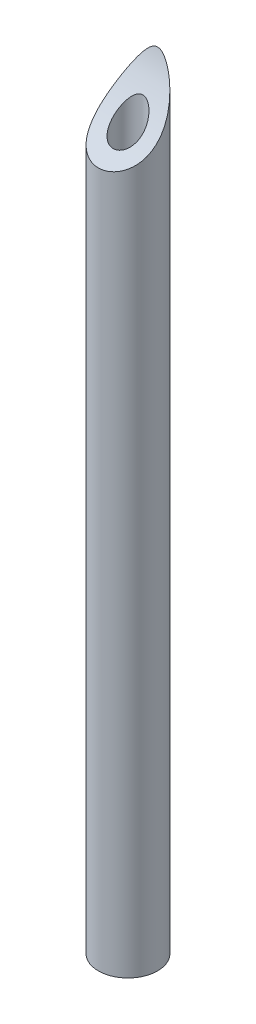
ISO-10303-21;
HEADER;
FILE_DESCRIPTION(('STEP AP214'),'2;1');
FILE_NAME('part.step','',(''),(''),'','','');
FILE_SCHEMA(('AUTOMOTIVE_DESIGN { 1 0 10303 214 1 1 1 1 }'));
ENDSEC;
DATA;
#1=APPLICATION_CONTEXT('core data for automotive mechanical design processes');
#2=APPLICATION_PROTOCOL_DEFINITION('international standard','automotive_design',2000,#1);
#3=PRODUCT_CONTEXT('',#1,'mechanical');
#4=PRODUCT('Part','Part','',(#3));
#5=PRODUCT_RELATED_PRODUCT_CATEGORY('part','',(#4));
#6=PRODUCT_DEFINITION_FORMATION('','',#4);
#7=PRODUCT_DEFINITION_CONTEXT('part definition',#1,'design');
#8=PRODUCT_DEFINITION('design','',#6,#7);
#9=PRODUCT_DEFINITION_SHAPE('','',#8);
#10=(LENGTH_UNIT() NAMED_UNIT(*) SI_UNIT(.MILLI.,.METRE.));
#11=(NAMED_UNIT(*) PLANE_ANGLE_UNIT() SI_UNIT($,.RADIAN.));
#12=(NAMED_UNIT(*) SI_UNIT($,.STERADIAN.) SOLID_ANGLE_UNIT());
#13=UNCERTAINTY_MEASURE_WITH_UNIT(LENGTH_MEASURE(1.E-05),#10,'distance_accuracy_value','');
#14=(GEOMETRIC_REPRESENTATION_CONTEXT(3) GLOBAL_UNCERTAINTY_ASSIGNED_CONTEXT((#13)) GLOBAL_UNIT_ASSIGNED_CONTEXT((#10,
#11,#12)) REPRESENTATION_CONTEXT('',''));
#15=CARTESIAN_POINT('',(0.,0.,0.));
#16=DIRECTION('',(0.,0.,1.));
#17=DIRECTION('',(1.,0.,0.));
#18=AXIS2_PLACEMENT_3D('',#15,#16,#17);
#19=CARTESIAN_POINT('',(0.,-26.,0.));
#20=DIRECTION('',(0.,1.,0.));
#21=DIRECTION('',(0.,0.,1.));
#22=AXIS2_PLACEMENT_3D('',#19,#20,#21);
#23=PLANE('',#22);
#24=CARTESIAN_POINT('',(0.,-26.,0.));
#25=DIRECTION('',(0.,1.,0.));
#26=DIRECTION('',(0.,0.,1.));
#27=AXIS2_PLACEMENT_3D('',#24,#25,#26);
#28=CIRCLE('',#27,2.);
#29=CARTESIAN_POINT('',(0.,-26.,2.));
#30=VERTEX_POINT('',#29);
#31=EDGE_CURVE('E10',#30,#30,#28,.T.);
#32=ORIENTED_EDGE('',*,*,#31,.F.);
#33=EDGE_LOOP('',(#32));
#34=FACE_BOUND('',#33,.T.);
#35=CARTESIAN_POINT('',(0.,-26.,0.));
#36=DIRECTION('',(0.,1.,0.));
#37=DIRECTION('',(0.,0.,1.));
#38=AXIS2_PLACEMENT_3D('',#35,#36,#37);
#39=CIRCLE('',#38,1.);
#40=CARTESIAN_POINT('',(0.,-26.,1.));
#41=VERTEX_POINT('',#40);
#42=EDGE_CURVE('E44',#41,#41,#39,.T.);
#43=ORIENTED_EDGE('',*,*,#42,.T.);
#44=EDGE_LOOP('',(#43));
#45=FACE_BOUND('',#44,.T.);
#46=ADVANCED_FACE('F31',(#34,#45),#23,.F.);
#47=CARTESIAN_POINT('',(0.,26.,0.));
#48=DIRECTION('',(0.,-1.,0.));
#49=DIRECTION('',(0.,0.,-1.));
#50=AXIS2_PLACEMENT_3D('',#47,#48,#49);
#51=CYLINDRICAL_SURFACE('',#50,2.);
#52=CARTESIAN_POINT('',(0.,26.,-2.));
#53=CARTESIAN_POINT('',(0.0310878947690985,25.9999942808491,-1.999998727697));
#54=CARTESIAN_POINT('',(0.0621975524528223,25.9971494572082,-1.99926567741975));
#55=CARTESIAN_POINT('',(0.12341024564645,25.9862003828218,-1.99642572281955));
#56=CARTESIAN_POINT('',(0.153511517116241,25.9780873746414,-1.99431653087398));
#57=CARTESIAN_POINT('',(0.223249895675937,25.9537190955612,-1.98791614642422));
#58=CARTESIAN_POINT('',(0.262151802155034,25.9355394871507,-1.98309983461464));
#59=CARTESIAN_POINT('',(0.336669094329099,25.8937726819504,-1.97182286913525));
#60=CARTESIAN_POINT('',(0.372273655216521,25.8701685024018,-1.96535704416839));
#61=CARTESIAN_POINT('',(0.450175155203674,25.8123750943179,-1.94918946551538));
#62=CARTESIAN_POINT('',(0.491547872499408,25.7770739539206,-1.93908876826176));
#63=CARTESIAN_POINT('',(0.570690927600747,25.7030424373323,-1.91728890066531));
#64=CARTESIAN_POINT('',(0.608453872271044,25.6643053239059,-1.9055865643166));
#65=CARTESIAN_POINT('',(0.681319573471942,25.5844945199435,-1.88076847358034));
#66=CARTESIAN_POINT('',(0.716408503260306,25.5434103845305,-1.86764612368862));
#67=CARTESIAN_POINT('',(0.784319627120026,25.4597941763478,-1.84015849409115));
#68=CARTESIAN_POINT('',(0.817140736338702,25.4172614249327,-1.82579262682809));
#69=CARTESIAN_POINT('',(0.892608053923797,25.3154359900162,-1.79041087314761));
#70=CARTESIAN_POINT('',(0.934442135251362,25.2557183648951,-1.76888861600763));
#71=CARTESIAN_POINT('',(1.01526273380204,25.1351765778855,-1.72376809896694));
#72=CARTESIAN_POINT('',(1.05424934187039,25.074352451376,-1.7001699053495));
#73=CARTESIAN_POINT('',(1.16768325209905,24.89069407425,-1.62625267775508));
#74=CARTESIAN_POINT('',(1.23849408267641,24.7668289615874,-1.57286427797166));
#75=CARTESIAN_POINT('',(1.37186216808576,24.5183502684363,-1.45798382306832));
#76=CARTESIAN_POINT('',(1.43441421522281,24.3937362670076,-1.39648670325817));
#77=CARTESIAN_POINT('',(1.55129737984981,24.145031529829,-1.26537848422254));
#78=CARTESIAN_POINT('',(1.60563408969926,24.0209404945315,-1.19577296222825));
#79=CARTESIAN_POINT('',(1.70675923401602,23.7711393399432,-1.04655950960577));
#80=CARTESIAN_POINT('',(1.75333484971276,23.645461993885,-0.966751376516435));
#81=CARTESIAN_POINT('',(1.83610518877757,23.3963855338672,-0.798445557399668));
#82=CARTESIAN_POINT('',(1.87229473010202,23.272987585822,-0.709943563100184));
#83=CARTESIAN_POINT('',(1.93233311346413,23.0301328564216,-0.524887268872868));
#84=CARTESIAN_POINT('',(1.95623843615992,22.9106604450038,-0.428372236286803));
#85=CARTESIAN_POINT('',(1.98960861773394,22.6764366578671,-0.227593511160441));
#86=CARTESIAN_POINT('',(1.99909033892628,22.5616799221763,-0.123339016502878));
#87=CARTESIAN_POINT('',(2.0008131860321,22.3346670907337,0.0953368906963445));
#88=CARTESIAN_POINT('',(1.99248442894864,22.2226132258703,0.209978523483726));
#89=CARTESIAN_POINT('',(1.95372400134949,22.0073141036363,0.443809747378913));
#90=CARTESIAN_POINT('',(1.92331372935891,21.9040604264339,0.562994829697625));
#91=CARTESIAN_POINT('',(1.84404276817447,21.7254603126861,0.781431598643422));
#92=CARTESIAN_POINT('',(1.79915311057094,21.6483428032867,0.880659031796422));
#93=CARTESIAN_POINT('',(1.68992462539414,21.5037808078892,1.07544337690252));
#94=CARTESIAN_POINT('',(1.62560679151417,21.4363259959916,1.17100412600262));
#95=CARTESIAN_POINT('',(1.48837605479918,21.3221838633185,1.33965954655366));
#96=CARTESIAN_POINT('',(1.4182764973412,21.2738982033179,1.41395629406399));
#97=CARTESIAN_POINT('',(1.26435840184996,21.1862862324826,1.5531079128099));
#98=CARTESIAN_POINT('',(1.18054327164358,21.1469577019141,1.61796512188748));
#99=CARTESIAN_POINT('',(1.00043923067451,21.0777209361945,1.73514023383558));
#100=CARTESIAN_POINT('',(0.904096537936832,21.0478553446816,1.78740112693899));
#101=CARTESIAN_POINT('',(0.701945346841409,20.9981365342587,1.87601660386672));
#102=CARTESIAN_POINT('',(0.596139160461151,20.9782808776969,1.91237506001814));
#103=CARTESIAN_POINT('',(0.387807902131573,20.9499608839673,1.96472892781995));
#104=CARTESIAN_POINT('',(0.285758276478955,20.9406772887668,1.98218269376112));
#105=CARTESIAN_POINT('',(0.0797856104879118,20.9306335681888,2.00107949596445));
#106=CARTESIAN_POINT('',(-0.0241368564659623,20.9298708770274,2.00252735186731));
#107=CARTESIAN_POINT('',(-0.226825550419774,20.9367353843997,1.98959389407428));
#108=CARTESIAN_POINT('',(-0.325640326974407,20.9440533279411,1.97579603831189));
#109=CARTESIAN_POINT('',(-0.51925755979014,20.9665712425132,1.93395428123615));
#110=CARTESIAN_POINT('',(-0.614060339261717,20.9817705772989,1.90591152988159));
#111=CARTESIAN_POINT('',(-0.79769123944514,21.0200998566896,1.83667552323919));
#112=CARTESIAN_POINT('',(-0.886479518939583,21.0432774692468,1.79540333016317));
#113=CARTESIAN_POINT('',(-1.05532887044436,21.0973614781157,1.70164974071834));
#114=CARTESIAN_POINT('',(-1.13538883511301,21.1282688534505,1.64916692457667));
#115=CARTESIAN_POINT('',(-1.2888505368235,21.1991422303673,1.53251248699221));
#116=CARTESIAN_POINT('',(-1.36174809647796,21.2394718881997,1.46790066567831));
#117=CARTESIAN_POINT('',(-1.49530031494697,21.3276642307005,1.33161257496571));
#118=CARTESIAN_POINT('',(-1.55595161592916,21.3755289750481,1.25993437601535));
#119=CARTESIAN_POINT('',(-1.67056318565302,21.4834833304412,1.10431966797978));
#120=CARTESIAN_POINT('',(-1.72313157370215,21.5443310914603,1.0198893277709));
#121=CARTESIAN_POINT('',(-1.81359498071895,21.673222500461,0.848683737584176));
#122=CARTESIAN_POINT('',(-1.85147904113698,21.7412714745048,0.76190678785355));
#123=CARTESIAN_POINT('',(-1.90594802488141,21.8657139872797,0.610048728978946));
#124=CARTESIAN_POINT('',(-1.92548562733135,21.9208082420936,0.544928574919242));
#125=CARTESIAN_POINT('',(-1.95749641921073,22.0339559080101,0.41551425381541));
#126=CARTESIAN_POINT('',(-1.96996683511504,22.0920104711603,0.351220420722518));
#127=CARTESIAN_POINT('',(-1.99770315813582,22.2701261951185,0.160385278110694));
#128=CARTESIAN_POINT('',(-2.003268428655,22.3940765374109,0.0359673859721931));
#129=CARTESIAN_POINT('',(-1.9946892376678,22.6116571755127,-0.168519392383094));
#130=CARTESIAN_POINT('',(-1.98585742725406,22.7034903054664,-0.250874401707882));
#131=CARTESIAN_POINT('',(-1.95905661987392,22.8901292370484,-0.410679192485915));
#132=CARTESIAN_POINT('',(-1.94108363959997,22.9849363176759,-0.488126818964921));
#133=CARTESIAN_POINT('',(-1.89712918874779,23.1771270792474,-0.63798257813347));
#134=CARTESIAN_POINT('',(-1.87112169121952,23.2745181796885,-0.710373381489342));
#135=CARTESIAN_POINT('',(-1.81210631409614,23.4710181188032,-0.849700803299288));
#136=CARTESIAN_POINT('',(-1.77909933804578,23.5701267342524,-0.916638124187173));
#137=CARTESIAN_POINT('',(-1.69496520451731,23.8024014531352,-1.06615463644853));
#138=CARTESIAN_POINT('',(-1.64144823635217,23.9360533455991,-1.1466423832145));
#139=CARTESIAN_POINT('',(-1.52452892046667,24.2045525502724,-1.29806386835375));
#140=CARTESIAN_POINT('',(-1.46111852819678,24.3394007503191,-1.36898974350598));
#141=CARTESIAN_POINT('',(-1.32507918978628,24.6083756017165,-1.50104548584114));
#142=CARTESIAN_POINT('',(-1.2524932828117,24.7425027556056,-1.56221825280025));
#143=CARTESIAN_POINT('',(-1.13583991252355,24.9420120216075,-1.64686348420683));
#144=CARTESIAN_POINT('',(-1.09568067409882,25.0082037473798,-1.67388173345679));
#145=CARTESIAN_POINT('',(-1.01239514542901,25.1396368598399,-1.72553238458315));
#146=CARTESIAN_POINT('',(-0.969269632738227,25.2048784901853,-1.75016540765706));
#147=CARTESIAN_POINT('',(-0.882973873946006,25.3287335283018,-1.79514268021152));
#148=CARTESIAN_POINT('',(-0.840071627054596,25.3874658844732,-1.81567172457178));
#149=CARTESIAN_POINT('',(-0.7503115032055,25.5028945841608,-1.85457098213796));
#150=CARTESIAN_POINT('',(-0.703443748939951,25.5595853105182,-1.87293551476625));
#151=CARTESIAN_POINT('',(-0.604045049488031,25.6697047696891,-1.90733877266839));
#152=CARTESIAN_POINT('',(-0.551460255204273,25.7230934260846,-1.92335131103426));
#153=CARTESIAN_POINT('',(-0.438796943035134,25.82242273184,-1.95213455212478));
#154=CARTESIAN_POINT('',(-0.378759034013631,25.8684008553919,-1.96492176338279));
#155=CARTESIAN_POINT('',(-0.284253215003327,25.9236924240341,-1.97991729531521));
#156=CARTESIAN_POINT('',(-0.253843258529949,25.9392767891619,-1.98407931458886));
#157=CARTESIAN_POINT('',(-0.190955416937835,25.9658457124901,-1.99111302863291));
#158=CARTESIAN_POINT('',(-0.158484047290031,25.9768440059142,-1.99398857827672));
#159=CARTESIAN_POINT('',(-0.104783772658006,25.989791316245,-1.99735866114104));
#160=CARTESIAN_POINT('',(-0.0840291162982459,25.9935936335713,-1.99834352847685));
#161=CARTESIAN_POINT('',(-0.0421863504483851,25.9987001202491,-1.99966468263138));
#162=CARTESIAN_POINT('',(-0.0210981870355084,26.000003881373,-2.00000086346428));
#163=CARTESIAN_POINT('',(0.,26.,-2.));
#164=B_SPLINE_CURVE_WITH_KNOTS('',3,(#52,#53,#54,#55,#56,#57,#58,#59,#60,#61,#62,#63,#64,#65,
#66,#67,#68,#69,#70,#71,#72,#73,#74,#75,#76,#77,#78,#79,#80,#81,#82,#83,#84,#85,#86,#87,#88,#89,
#90,#91,#92,#93,#94,#95,#96,#97,#98,#99,#100,#101,#102,#103,#104,#105,#106,#107,#108,#109,#110,
#111,#112,#113,#114,#115,#116,#117,#118,#119,#120,#121,#122,#123,#124,#125,#126,#127,#128,#129,
#130,#131,#132,#133,#134,#135,#136,#137,#138,#139,#140,#141,#142,#143,#144,#145,#146,#147,#148,
#149,#150,#151,#152,#153,#154,#155,#156,#157,#158,#159,#160,#161,#162,#163),.UNSPECIFIED.,.T.,
.F.,(4,2,2,2,2,2,2,2,2,2,2,2,2,2,2,2,2,2,2,2,2,2,2,2,2,2,2,2,2,2,2,2,2,2,2,2,2,2,2,2,2,2,2,2,2,
2,2,2,2,2,2,2,2,2,2,4),(0.,0.0931756485957047,0.186506583290679,0.315388407692429,
0.444679357061124,0.610236983690221,0.776126731076783,0.94282304688627,1.10959856056961,
1.33754906273167,1.5654922892257,2.02197012187718,2.47873443234039,2.93518639973008,
3.40260949001549,3.87026539323324,4.33575141358181,4.80069282514209,5.28073307883135,
5.76030875988342,6.15909732529281,6.55745650011536,6.89496985520589,7.23239947733333,
7.57132874517889,7.9101754359534,8.22045424035803,8.53063961220586,8.82935284507989,
9.12804196732931,9.42854757096523,9.72909125481537,10.0440636398282,10.3591222709791,
10.7075956998319,11.0563286873622,11.3185041663458,11.5807824652589,12.1056433831471,
12.476226176396,12.846970591361,13.2189288144507,13.5908390516031,14.0850063098014,
14.5795775001787,15.0719094002568,15.3178412522199,15.5637088815601,15.790321502246,
16.0175161960376,16.2470747385486,16.475433307961,16.5784207751428,16.681097541487,
16.7443220269853,16.8075568415595),.UNSPECIFIED.);
#165=CARTESIAN_POINT('',(0.,26.,-2.));
#166=VERTEX_POINT('',#165);
#167=EDGE_CURVE('E48',#166,#166,#164,.T.);
#168=ORIENTED_EDGE('',*,*,#167,.T.);
#169=EDGE_LOOP('',(#168));
#170=FACE_BOUND('',#169,.T.);
#171=ORIENTED_EDGE('',*,*,#31,.T.);
#172=EDGE_LOOP('',(#171));
#173=FACE_BOUND('',#172,.T.);
#174=ADVANCED_FACE('F33',(#170,#173),#51,.T.);
#175=CARTESIAN_POINT('',(0.,26.,0.));
#176=DIRECTION('',(0.,-1.,0.));
#177=DIRECTION('',(0.,0.,-1.));
#178=AXIS2_PLACEMENT_3D('',#175,#176,#177);
#179=CYLINDRICAL_SURFACE('',#178,1.);
#180=CARTESIAN_POINT('',(0.,23.699775193687,-1.));
#181=CARTESIAN_POINT('',(0.032438599522325,23.6997719883114,-0.999998155329849));
#182=CARTESIAN_POINT('',(0.0648937978794085,23.6972710675918,-0.998405726642176));
#183=CARTESIAN_POINT('',(0.128795310177033,23.6875493414851,-0.992193314227428));
#184=CARTESIAN_POINT('',(0.160240250422129,23.6803223730239,-0.987569377195947));
#185=CARTESIAN_POINT('',(0.228876338743404,23.6595880107276,-0.97422735304499));
#186=CARTESIAN_POINT('',(0.26558768669384,23.6449756721932,-0.964783724765259));
#187=CARTESIAN_POINT('',(0.335734070941233,23.6111008901956,-0.942678508106985));
#188=CARTESIAN_POINT('',(0.369162389685543,23.5918291807166,-0.930010504783599));
#189=CARTESIAN_POINT('',(0.450462477708709,23.5383175669993,-0.894432799144377));
#190=CARTESIAN_POINT('',(0.495989589816555,23.501724704985,-0.869751861190008));
#191=CARTESIAN_POINT('',(0.579992219423968,23.4238787162728,-0.816149432884878));
#192=CARTESIAN_POINT('',(0.618449022806414,23.3826136759754,-0.787217043204981));
#193=CARTESIAN_POINT('',(0.682989193067237,23.3047846740502,-0.731442661601425));
#194=CARTESIAN_POINT('',(0.710060671688254,23.2686572161375,-0.705117150594802));
#195=CARTESIAN_POINT('',(0.760354985600252,23.1951622078871,-0.650566365448371));
#196=CARTESIAN_POINT('',(0.783575429525804,23.1577939041805,-0.622339926075777));
#197=CARTESIAN_POINT('',(0.847861789768793,23.0445075718811,-0.535127416703654));
#198=CARTESIAN_POINT('',(0.883541002711873,22.9674229698434,-0.473618697856788));
#199=CARTESIAN_POINT('',(0.942510177976886,22.8091012514833,-0.342192152125232));
#200=CARTESIAN_POINT('',(0.965142301284832,22.7278386071398,-0.272015518743745));
#201=CARTESIAN_POINT('',(0.994663457332478,22.566700950201,-0.126934864238775));
#202=CARTESIAN_POINT('',(1.00156706704703,22.4868247208992,-0.0520352865062108));
#203=CARTESIAN_POINT('',(0.998128066936928,22.3425777970034,0.0889246974715048));
#204=CARTESIAN_POINT('',(0.990298444518539,22.2777262647959,0.154550292065766));
#205=CARTESIAN_POINT('',(0.96050066598252,22.1518626874982,0.286338422614588));
#206=CARTESIAN_POINT('',(0.938549833208662,22.0908460384623,0.3525002027362));
#207=CARTESIAN_POINT('',(0.885951437077761,21.9886469922062,0.466947898352547));
#208=CARTESIAN_POINT('',(0.858690016797134,21.9462360823516,0.515687997004665));
#209=CARTESIAN_POINT('',(0.794284447846254,21.8658363358044,0.610222943536248));
#210=CARTESIAN_POINT('',(0.757154017396476,21.8278414652537,0.656021770983076));
#211=CARTESIAN_POINT('',(0.680907878465301,21.7644526447864,0.733983820053241));
#212=CARTESIAN_POINT('',(0.643581439502006,21.7380449698647,0.767066972482633));
#213=CARTESIAN_POINT('',(0.562476264216512,21.6897875948292,0.828371781445919));
#214=CARTESIAN_POINT('',(0.518699161420668,21.667936744147,0.856594664851801));
#215=CARTESIAN_POINT('',(0.425004932276729,21.6295133886269,0.906760867197145));
#216=CARTESIAN_POINT('',(0.375041058619861,21.612984953134,0.928651612164102));
#217=CARTESIAN_POINT('',(0.270679707085024,21.5862952339997,0.964241599010053));
#218=CARTESIAN_POINT('',(0.216286384589626,21.5761280587177,0.977948420095952));
#219=CARTESIAN_POINT('',(0.112878291580648,21.5636622330866,0.994793333535959));
#220=CARTESIAN_POINT('',(0.0641643520304994,21.5604675856144,0.999133923489211));
#221=CARTESIAN_POINT('',(-0.033424486901219,21.5593648812194,1.00062982855967));
#222=CARTESIAN_POINT('',(-0.0822993035631205,21.5614544350657,0.997788391002739));
#223=CARTESIAN_POINT('',(-0.175282802307937,21.5704932424235,0.985557806911399));
#224=CARTESIAN_POINT('',(-0.219487984944818,21.5770980911303,0.97663281723464));
#225=CARTESIAN_POINT('',(-0.305515001501782,21.5945421828938,0.953230355198831));
#226=CARTESIAN_POINT('',(-0.347336729899047,21.605381613262,0.938752637222498));
#227=CARTESIAN_POINT('',(-0.429341264103467,21.631439232567,0.904281412197737));
#228=CARTESIAN_POINT('',(-0.469388001062708,21.6468177421679,0.884087319557517));
#229=CARTESIAN_POINT('',(-0.545270972211334,21.6812528952384,0.83941700882326));
#230=CARTESIAN_POINT('',(-0.581105701571309,21.7003108468797,0.814939268031298));
#231=CARTESIAN_POINT('',(-0.652522069240638,21.7442470142416,0.759288248850612));
#232=CARTESIAN_POINT('',(-0.687479690849916,21.7695584230207,0.727658785773704));
#233=CARTESIAN_POINT('',(-0.751449471714443,21.8235114821193,0.661399481909915));
#234=CARTESIAN_POINT('',(-0.780457505429607,21.8521554218437,0.62676758270109));
#235=CARTESIAN_POINT('',(-0.845934780520827,21.9274370100054,0.5374276222587));
#236=CARTESIAN_POINT('',(-0.878701813710396,21.9758201745545,0.481462630262031));
#237=CARTESIAN_POINT('',(-0.932035076382859,22.0770726035672,0.367791147967517));
#238=CARTESIAN_POINT('',(-0.952574720564029,22.129951359536,0.310081147584624));
#239=CARTESIAN_POINT('',(-0.987529130948543,22.2565212876604,0.176098223182815));
#240=CARTESIAN_POINT('',(-0.99779996356445,22.33140239455,0.0998722792068114));
#241=CARTESIAN_POINT('',(-1.00156974512023,22.4843716397237,-0.0496647113395155));
#242=CARTESIAN_POINT('',(-0.995049082988105,22.5624634230199,-0.122972247939241));
#243=CARTESIAN_POINT('',(-0.966658904125665,22.7215794675518,-0.266519702206161));
#244=CARTESIAN_POINT('',(-0.944479527702873,22.8026310616969,-0.336666750921663));
#245=CARTESIAN_POINT('',(-0.885164801337417,22.9641544549622,-0.471047069821269));
#246=CARTESIAN_POINT('',(-0.848039386854334,23.0446266031707,-0.5352842338514));
#247=CARTESIAN_POINT('',(-0.771265145620164,23.1791666028092,-0.638744720525661));
#248=CARTESIAN_POINT('',(-0.735525514109159,23.2340772598156,-0.679791401373512));
#249=CARTESIAN_POINT('',(-0.655289630873728,23.3406001454138,-0.757439692167745));
#250=CARTESIAN_POINT('',(-0.610807385648315,23.3922174772639,-0.794048262660008));
#251=CARTESIAN_POINT('',(-0.529258845099,23.4719259483255,-0.8493351434042));
#252=CARTESIAN_POINT('',(-0.495183447516158,23.5018541942479,-0.869759189675603));
#253=CARTESIAN_POINT('',(-0.422263205838736,23.5577204405304,-0.907399116944564));
#254=CARTESIAN_POINT('',(-0.383425363042309,23.583664175013,-0.924619615867779));
#255=CARTESIAN_POINT('',(-0.311914547741843,23.6232773514239,-0.950652154766904));
#256=CARTESIAN_POINT('',(-0.280409123376464,23.6383694621154,-0.960479057068428));
#257=CARTESIAN_POINT('',(-0.21493990482532,23.6641994807313,-0.97720754596008));
#258=CARTESIAN_POINT('',(-0.180981814200699,23.6749471301963,-0.984115678869437));
#259=CARTESIAN_POINT('',(-0.122358993184381,23.6884614206349,-0.992777809250696));
#260=CARTESIAN_POINT('',(-0.0981636882463568,23.6926783066109,-0.995471665986925));
#261=CARTESIAN_POINT('',(-0.0493154319725357,23.6983363129598,-0.999083399464399));
#262=CARTESIAN_POINT('',(-0.0246625132995307,23.6997776306793,-1.00000140247122));
#263=CARTESIAN_POINT('',(0.,23.699775193687,-1.));
#264=B_SPLINE_CURVE_WITH_KNOTS('',3,(#180,#181,#182,#183,#184,#185,#186,#187,#188,#189,#190,
#191,#192,#193,#194,#195,#196,#197,#198,#199,#200,#201,#202,#203,#204,#205,#206,#207,#208,#209,
#210,#211,#212,#213,#214,#215,#216,#217,#218,#219,#220,#221,#222,#223,#224,#225,#226,#227,#228,
#229,#230,#231,#232,#233,#234,#235,#236,#237,#238,#239,#240,#241,#242,#243,#244,#245,#246,#247,
#248,#249,#250,#251,#252,#253,#254,#255,#256,#257,#258,#259,#260,#261,#262,#263),.UNSPECIFIED.,
.T.,.F.,(4,2,2,2,2,2,2,2,2,2,2,2,2,2,2,2,2,2,2,2,2,2,2,2,2,2,2,2,2,2,2,2,2,2,2,2,2,2,2,2,2,4),
(0.,0.097216764564623,0.194560559614738,0.315754979851233,0.437192429141174,0.626369275155462,
0.816039855088666,0.97260683579902,1.12927067833462,1.44266261647928,1.77071882753133,
2.09847087660457,2.37529804335864,2.65178625539615,2.86142149308606,3.07076684177759,
3.23941389937229,3.40801832298739,3.57798488313663,3.74779379055489,3.8940426104055,
4.04022531625002,4.1763459179461,4.31247254144391,4.45414187792199,4.59586167592336,
4.75578921008153,4.9158272684141,5.15721242891333,5.39912052026762,5.71944794471792,
6.0401496546411,6.36738212753205,6.6943974291146,6.92583111490171,7.15689700064734,
7.30576563011752,7.45441797328114,7.56292631055852,7.67118997274609,7.7451074746101,
7.81901972064779),.UNSPECIFIED.);
#265=CARTESIAN_POINT('',(0.,23.699775193687,-1.));
#266=VERTEX_POINT('',#265);
#267=EDGE_CURVE('E36',#266,#266,#264,.T.);
#268=ORIENTED_EDGE('',*,*,#267,.F.);
#269=EDGE_LOOP('',(#268));
#270=FACE_BOUND('',#269,.T.);
#271=ORIENTED_EDGE('',*,*,#42,.F.);
#272=EDGE_LOOP('',(#271));
#273=FACE_BOUND('',#272,.T.);
#274=ADVANCED_FACE('F57',(#270,#273),#179,.F.);
#275=CARTESIAN_POINT('',(-2.,28.,5.74596669241483));
#276=DIRECTION('',(1.,0.,0.));
#277=DIRECTION('',(0.,0.,-1.));
#278=AXIS2_PLACEMENT_3D('',#275,#276,#277);
#279=CYLINDRICAL_SURFACE('',#278,8.);
#280=ORIENTED_EDGE('',*,*,#267,.T.);
#281=EDGE_LOOP('',(#280));
#282=FACE_BOUND('',#281,.T.);
#283=ORIENTED_EDGE('',*,*,#167,.F.);
#284=EDGE_LOOP('',(#283));
#285=FACE_BOUND('',#284,.T.);
#286=ADVANCED_FACE('F54',(#282,#285),#279,.F.);
#287=CLOSED_SHELL('',(#46,#174,#274,#286));
#288=MANIFOLD_SOLID_BREP('B2',#287);
#289=ADVANCED_BREP_SHAPE_REPRESENTATION('',(#18,#288),#14);
#290=SHAPE_DEFINITION_REPRESENTATION(#9,#289);
ENDSEC;
END-ISO-10303-21;
